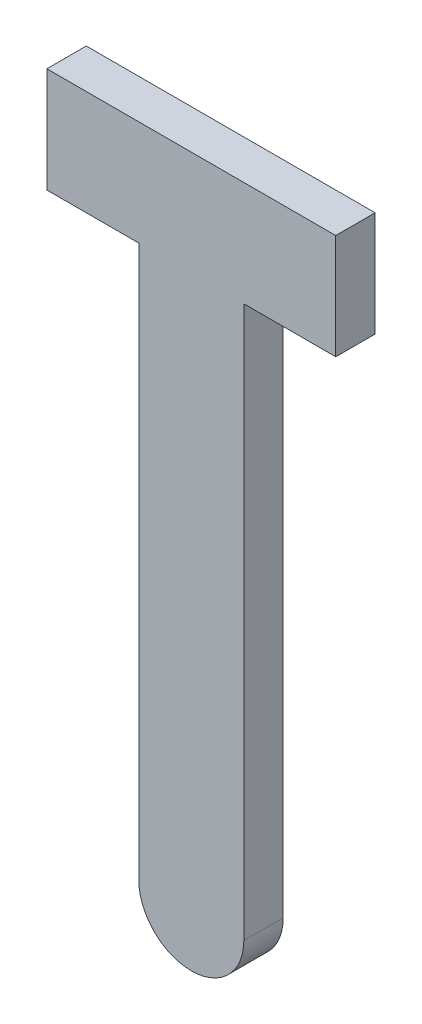
ISO-10303-21;
HEADER;
FILE_DESCRIPTION(('STEP AP214'),'2;1');
FILE_NAME('part.step','',(''),(''),'','','');
FILE_SCHEMA(('AUTOMOTIVE_DESIGN { 1 0 10303 214 1 1 1 1 }'));
ENDSEC;
DATA;
#1=APPLICATION_CONTEXT('core data for automotive mechanical design processes');
#2=APPLICATION_PROTOCOL_DEFINITION('international standard','automotive_design',2000,#1);
#3=PRODUCT_CONTEXT('',#1,'mechanical');
#4=PRODUCT('Part','Part','',(#3));
#5=PRODUCT_RELATED_PRODUCT_CATEGORY('part','',(#4));
#6=PRODUCT_DEFINITION_FORMATION('','',#4);
#7=PRODUCT_DEFINITION_CONTEXT('part definition',#1,'design');
#8=PRODUCT_DEFINITION('design','',#6,#7);
#9=PRODUCT_DEFINITION_SHAPE('','',#8);
#10=(LENGTH_UNIT() NAMED_UNIT(*) SI_UNIT(.MILLI.,.METRE.));
#11=(NAMED_UNIT(*) PLANE_ANGLE_UNIT() SI_UNIT($,.RADIAN.));
#12=(NAMED_UNIT(*) SI_UNIT($,.STERADIAN.) SOLID_ANGLE_UNIT());
#13=UNCERTAINTY_MEASURE_WITH_UNIT(LENGTH_MEASURE(1.E-05),#10,'distance_accuracy_value','');
#14=(GEOMETRIC_REPRESENTATION_CONTEXT(3) GLOBAL_UNCERTAINTY_ASSIGNED_CONTEXT((#13)) GLOBAL_UNIT_ASSIGNED_CONTEXT((#10,
#11,#12)) REPRESENTATION_CONTEXT('',''));
#15=CARTESIAN_POINT('',(0.,0.,0.));
#16=DIRECTION('',(0.,0.,1.));
#17=DIRECTION('',(1.,0.,0.));
#18=AXIS2_PLACEMENT_3D('',#15,#16,#17);
#19=CARTESIAN_POINT('',(-5.5,0.,1.5));
#20=DIRECTION('',(1.,0.,0.));
#21=DIRECTION('',(0.,0.,-1.));
#22=AXIS2_PLACEMENT_3D('',#19,#20,#21);
#23=PLANE('',#22);
#24=DIRECTION('',(0.,-1.,0.));
#25=VECTOR('',#24,1.);
#26=CARTESIAN_POINT('',(-5.5,0.,0.));
#27=LINE('',#26,#25);
#28=CARTESIAN_POINT('',(-5.5,0.,0.));
#29=VERTEX_POINT('',#28);
#30=CARTESIAN_POINT('',(-5.5,-4.,0.));
#31=VERTEX_POINT('',#30);
#32=EDGE_CURVE('E129',#29,#31,#27,.T.);
#33=ORIENTED_EDGE('',*,*,#32,.T.);
#34=DIRECTION('',(0.,0.,-1.));
#35=VECTOR('',#34,1.);
#36=CARTESIAN_POINT('',(-5.5,-4.,1.5));
#37=LINE('',#36,#35);
#38=CARTESIAN_POINT('',(-5.5,-4.,1.5));
#39=VERTEX_POINT('',#38);
#40=EDGE_CURVE('E11',#39,#31,#37,.T.);
#41=ORIENTED_EDGE('',*,*,#40,.F.);
#42=DIRECTION('',(0.,-1.,0.));
#43=VECTOR('',#42,1.);
#44=CARTESIAN_POINT('',(-5.5,0.,1.5));
#45=LINE('',#44,#43);
#46=CARTESIAN_POINT('',(-5.5,0.,1.5));
#47=VERTEX_POINT('',#46);
#48=EDGE_CURVE('E144',#47,#39,#45,.T.);
#49=ORIENTED_EDGE('',*,*,#48,.F.);
#50=DIRECTION('',(0.,0.,-1.));
#51=VECTOR('',#50,1.);
#52=CARTESIAN_POINT('',(-5.5,0.,1.5));
#53=LINE('',#52,#51);
#54=EDGE_CURVE('E125',#47,#29,#53,.T.);
#55=ORIENTED_EDGE('',*,*,#54,.T.);
#56=EDGE_LOOP('',(#33,#41,#49,#55));
#57=FACE_BOUND('',#56,.T.);
#58=ADVANCED_FACE('F32',(#57),#23,.F.);
#59=CARTESIAN_POINT('',(-5.5,-4.,1.5));
#60=DIRECTION('',(0.,1.,0.));
#61=DIRECTION('',(0.,0.,1.));
#62=AXIS2_PLACEMENT_3D('',#59,#60,#61);
#63=PLANE('',#62);
#64=DIRECTION('',(1.,0.,0.));
#65=VECTOR('',#64,1.);
#66=CARTESIAN_POINT('',(-5.5,-4.,0.));
#67=LINE('',#66,#65);
#68=CARTESIAN_POINT('',(-2.,-4.,0.));
#69=VERTEX_POINT('',#68);
#70=EDGE_CURVE('E132',#31,#69,#67,.T.);
#71=ORIENTED_EDGE('',*,*,#70,.T.);
#72=DIRECTION('',(0.,0.,-1.));
#73=VECTOR('',#72,1.);
#74=CARTESIAN_POINT('',(-2.,-4.,1.5));
#75=LINE('',#74,#73);
#76=CARTESIAN_POINT('',(-2.,-4.,1.5));
#77=VERTEX_POINT('',#76);
#78=EDGE_CURVE('E40',#77,#69,#75,.T.);
#79=ORIENTED_EDGE('',*,*,#78,.F.);
#80=DIRECTION('',(1.,0.,0.));
#81=VECTOR('',#80,1.);
#82=CARTESIAN_POINT('',(-5.5,-4.,1.5));
#83=LINE('',#82,#81);
#84=EDGE_CURVE('E91',#39,#77,#83,.T.);
#85=ORIENTED_EDGE('',*,*,#84,.F.);
#86=ORIENTED_EDGE('',*,*,#40,.T.);
#87=EDGE_LOOP('',(#71,#79,#85,#86));
#88=FACE_BOUND('',#87,.T.);
#89=ADVANCED_FACE('F179',(#88),#63,.F.);
#90=CARTESIAN_POINT('',(-2.,-4.,1.5));
#91=DIRECTION('',(1.,0.,0.));
#92=DIRECTION('',(0.,1.,0.));
#93=AXIS2_PLACEMENT_3D('',#90,#91,#92);
#94=PLANE('',#93);
#95=DIRECTION('',(0.,-1.,0.));
#96=VECTOR('',#95,1.);
#97=CARTESIAN_POINT('',(-2.,-4.,0.));
#98=LINE('',#97,#96);
#99=CARTESIAN_POINT('',(-2.,-25.,0.));
#100=VERTEX_POINT('',#99);
#101=EDGE_CURVE('E134',#69,#100,#98,.T.);
#102=ORIENTED_EDGE('',*,*,#101,.T.);
#103=DIRECTION('',(0.,0.,-1.));
#104=VECTOR('',#103,1.);
#105=CARTESIAN_POINT('',(-2.,-25.,1.5));
#106=LINE('',#105,#104);
#107=CARTESIAN_POINT('',(-2.,-25.,1.5));
#108=VERTEX_POINT('',#107);
#109=EDGE_CURVE('E151',#108,#100,#106,.T.);
#110=ORIENTED_EDGE('',*,*,#109,.F.);
#111=DIRECTION('',(0.,-1.,0.));
#112=VECTOR('',#111,1.);
#113=CARTESIAN_POINT('',(-2.,-4.,1.5));
#114=LINE('',#113,#112);
#115=EDGE_CURVE('E159',#77,#108,#114,.T.);
#116=ORIENTED_EDGE('',*,*,#115,.F.);
#117=ORIENTED_EDGE('',*,*,#78,.T.);
#118=EDGE_LOOP('',(#102,#110,#116,#117));
#119=FACE_BOUND('',#118,.T.);
#120=ADVANCED_FACE('F157',(#119),#94,.F.);
#121=CARTESIAN_POINT('',(0.,-25.,1.5));
#122=DIRECTION('',(0.,0.,-1.));
#123=DIRECTION('',(-1.,0.,0.));
#124=AXIS2_PLACEMENT_3D('',#121,#122,#123);
#125=CYLINDRICAL_SURFACE('',#124,2.);
#126=CARTESIAN_POINT('',(0.,-25.,0.));
#127=DIRECTION('',(0.,0.,1.));
#128=DIRECTION('',(1.,0.,0.));
#129=AXIS2_PLACEMENT_3D('',#126,#127,#128);
#130=CIRCLE('',#129,2.);
#131=CARTESIAN_POINT('',(2.,-25.,0.));
#132=VERTEX_POINT('',#131);
#133=EDGE_CURVE('E136',#100,#132,#130,.T.);
#134=ORIENTED_EDGE('',*,*,#133,.T.);
#135=DIRECTION('',(0.,0.,-1.));
#136=VECTOR('',#135,1.);
#137=CARTESIAN_POINT('',(2.,-25.,1.5));
#138=LINE('',#137,#136);
#139=CARTESIAN_POINT('',(2.,-25.,1.5));
#140=VERTEX_POINT('',#139);
#141=EDGE_CURVE('E148',#140,#132,#138,.T.);
#142=ORIENTED_EDGE('',*,*,#141,.F.);
#143=CARTESIAN_POINT('',(0.,-25.,1.5));
#144=DIRECTION('',(0.,0.,1.));
#145=DIRECTION('',(1.,0.,0.));
#146=AXIS2_PLACEMENT_3D('',#143,#144,#145);
#147=CIRCLE('',#146,2.);
#148=EDGE_CURVE('E171',#108,#140,#147,.T.);
#149=ORIENTED_EDGE('',*,*,#148,.F.);
#150=ORIENTED_EDGE('',*,*,#109,.T.);
#151=EDGE_LOOP('',(#134,#142,#149,#150));
#152=FACE_BOUND('',#151,.T.);
#153=ADVANCED_FACE('F167',(#152),#125,.T.);
#154=CARTESIAN_POINT('',(2.,-4.,1.5));
#155=DIRECTION('',(-1.,0.,0.));
#156=DIRECTION('',(0.,-1.,0.));
#157=AXIS2_PLACEMENT_3D('',#154,#155,#156);
#158=PLANE('',#157);
#159=DIRECTION('',(0.,1.,0.));
#160=VECTOR('',#159,1.);
#161=CARTESIAN_POINT('',(2.,-4.,0.));
#162=LINE('',#161,#160);
#163=CARTESIAN_POINT('',(2.,-4.,0.));
#164=VERTEX_POINT('',#163);
#165=EDGE_CURVE('E138',#132,#164,#162,.T.);
#166=ORIENTED_EDGE('',*,*,#165,.T.);
#167=DIRECTION('',(0.,0.,-1.));
#168=VECTOR('',#167,1.);
#169=CARTESIAN_POINT('',(2.,-4.,1.5));
#170=LINE('',#169,#168);
#171=CARTESIAN_POINT('',(2.,-4.,1.5));
#172=VERTEX_POINT('',#171);
#173=EDGE_CURVE('E119',#172,#164,#170,.T.);
#174=ORIENTED_EDGE('',*,*,#173,.F.);
#175=DIRECTION('',(0.,1.,0.));
#176=VECTOR('',#175,1.);
#177=CARTESIAN_POINT('',(2.,-4.,1.5));
#178=LINE('',#177,#176);
#179=EDGE_CURVE('E110',#140,#172,#178,.T.);
#180=ORIENTED_EDGE('',*,*,#179,.F.);
#181=ORIENTED_EDGE('',*,*,#141,.T.);
#182=EDGE_LOOP('',(#166,#174,#180,#181));
#183=FACE_BOUND('',#182,.T.);
#184=ADVANCED_FACE('F170',(#183),#158,.F.);
#185=CARTESIAN_POINT('',(2.,-4.,1.5));
#186=DIRECTION('',(0.,1.,0.));
#187=DIRECTION('',(0.,0.,1.));
#188=AXIS2_PLACEMENT_3D('',#185,#186,#187);
#189=PLANE('',#188);
#190=DIRECTION('',(1.,0.,0.));
#191=VECTOR('',#190,1.);
#192=CARTESIAN_POINT('',(2.,-4.,0.));
#193=LINE('',#192,#191);
#194=CARTESIAN_POINT('',(5.5,-4.,0.));
#195=VERTEX_POINT('',#194);
#196=EDGE_CURVE('E118',#164,#195,#193,.T.);
#197=ORIENTED_EDGE('',*,*,#196,.T.);
#198=DIRECTION('',(0.,0.,-1.));
#199=VECTOR('',#198,1.);
#200=CARTESIAN_POINT('',(5.5,-4.,1.5));
#201=LINE('',#200,#199);
#202=CARTESIAN_POINT('',(5.5,-4.,1.5));
#203=VERTEX_POINT('',#202);
#204=EDGE_CURVE('E115',#203,#195,#201,.T.);
#205=ORIENTED_EDGE('',*,*,#204,.F.);
#206=DIRECTION('',(1.,0.,0.));
#207=VECTOR('',#206,1.);
#208=CARTESIAN_POINT('',(2.,-4.,1.5));
#209=LINE('',#208,#207);
#210=EDGE_CURVE('E104',#172,#203,#209,.T.);
#211=ORIENTED_EDGE('',*,*,#210,.F.);
#212=ORIENTED_EDGE('',*,*,#173,.T.);
#213=EDGE_LOOP('',(#197,#205,#211,#212));
#214=FACE_BOUND('',#213,.T.);
#215=ADVANCED_FACE('F116',(#214),#189,.F.);
#216=CARTESIAN_POINT('',(5.5,-4.,1.5));
#217=DIRECTION('',(-1.,0.,0.));
#218=DIRECTION('',(0.,-1.,0.));
#219=AXIS2_PLACEMENT_3D('',#216,#217,#218);
#220=PLANE('',#219);
#221=DIRECTION('',(0.,1.,0.));
#222=VECTOR('',#221,1.);
#223=CARTESIAN_POINT('',(5.5,-4.,0.));
#224=LINE('',#223,#222);
#225=CARTESIAN_POINT('',(5.5,0.,0.));
#226=VERTEX_POINT('',#225);
#227=EDGE_CURVE('E77',#195,#226,#224,.T.);
#228=ORIENTED_EDGE('',*,*,#227,.T.);
#229=DIRECTION('',(0.,0.,-1.));
#230=VECTOR('',#229,1.);
#231=CARTESIAN_POINT('',(5.5,0.,1.5));
#232=LINE('',#231,#230);
#233=CARTESIAN_POINT('',(5.5,0.,1.5));
#234=VERTEX_POINT('',#233);
#235=EDGE_CURVE('E120',#234,#226,#232,.T.);
#236=ORIENTED_EDGE('',*,*,#235,.F.);
#237=DIRECTION('',(0.,1.,0.));
#238=VECTOR('',#237,1.);
#239=CARTESIAN_POINT('',(5.5,-4.,1.5));
#240=LINE('',#239,#238);
#241=EDGE_CURVE('E108',#203,#234,#240,.T.);
#242=ORIENTED_EDGE('',*,*,#241,.F.);
#243=ORIENTED_EDGE('',*,*,#204,.T.);
#244=EDGE_LOOP('',(#228,#236,#242,#243));
#245=FACE_BOUND('',#244,.T.);
#246=ADVANCED_FACE('F122',(#245),#220,.F.);
#247=CARTESIAN_POINT('',(-5.5,0.,1.5));
#248=DIRECTION('',(0.,-1.,0.));
#249=DIRECTION('',(1.,0.,0.));
#250=AXIS2_PLACEMENT_3D('',#247,#248,#249);
#251=PLANE('',#250);
#252=DIRECTION('',(-1.,0.,0.));
#253=VECTOR('',#252,1.);
#254=CARTESIAN_POINT('',(-5.5,0.,0.));
#255=LINE('',#254,#253);
#256=EDGE_CURVE('E83',#226,#29,#255,.T.);
#257=ORIENTED_EDGE('',*,*,#256,.T.);
#258=ORIENTED_EDGE('',*,*,#54,.F.);
#259=DIRECTION('',(-1.,0.,0.));
#260=VECTOR('',#259,1.);
#261=CARTESIAN_POINT('',(-5.5,0.,1.5));
#262=LINE('',#261,#260);
#263=EDGE_CURVE('E48',#234,#47,#262,.T.);
#264=ORIENTED_EDGE('',*,*,#263,.F.);
#265=ORIENTED_EDGE('',*,*,#235,.T.);
#266=EDGE_LOOP('',(#257,#258,#264,#265));
#267=FACE_BOUND('',#266,.T.);
#268=ADVANCED_FACE('F195',(#267),#251,.F.);
#269=CARTESIAN_POINT('',(0.,-25.,1.5));
#270=DIRECTION('',(0.,0.,1.));
#271=DIRECTION('',(1.,0.,0.));
#272=AXIS2_PLACEMENT_3D('',#269,#270,#271);
#273=PLANE('',#272);
#274=ORIENTED_EDGE('',*,*,#48,.T.);
#275=ORIENTED_EDGE('',*,*,#84,.T.);
#276=ORIENTED_EDGE('',*,*,#115,.T.);
#277=ORIENTED_EDGE('',*,*,#148,.T.);
#278=ORIENTED_EDGE('',*,*,#179,.T.);
#279=ORIENTED_EDGE('',*,*,#210,.T.);
#280=ORIENTED_EDGE('',*,*,#241,.T.);
#281=ORIENTED_EDGE('',*,*,#263,.T.);
#282=EDGE_LOOP('',(#274,#275,#276,#277,#278,#279,#280,#281));
#283=FACE_BOUND('',#282,.T.);
#284=ADVANCED_FACE('F106',(#283),#273,.T.);
#285=CARTESIAN_POINT('',(0.,-25.,0.));
#286=DIRECTION('',(0.,0.,1.));
#287=DIRECTION('',(1.,0.,0.));
#288=AXIS2_PLACEMENT_3D('',#285,#286,#287);
#289=PLANE('',#288);
#290=ORIENTED_EDGE('',*,*,#32,.F.);
#291=ORIENTED_EDGE('',*,*,#256,.F.);
#292=ORIENTED_EDGE('',*,*,#227,.F.);
#293=ORIENTED_EDGE('',*,*,#196,.F.);
#294=ORIENTED_EDGE('',*,*,#165,.F.);
#295=ORIENTED_EDGE('',*,*,#133,.F.);
#296=ORIENTED_EDGE('',*,*,#101,.F.);
#297=ORIENTED_EDGE('',*,*,#70,.F.);
#298=EDGE_LOOP('',(#290,#291,#292,#293,#294,#295,#296,#297));
#299=FACE_BOUND('',#298,.T.);
#300=ADVANCED_FACE('F163',(#299),#289,.F.);
#301=CLOSED_SHELL('',(#58,#89,#120,#153,#184,#215,#246,#268,#284,#300));
#302=MANIFOLD_SOLID_BREP('B2',#301);
#303=ADVANCED_BREP_SHAPE_REPRESENTATION('',(#18,#302),#14);
#304=SHAPE_DEFINITION_REPRESENTATION(#9,#303);
ENDSEC;
END-ISO-10303-21;
